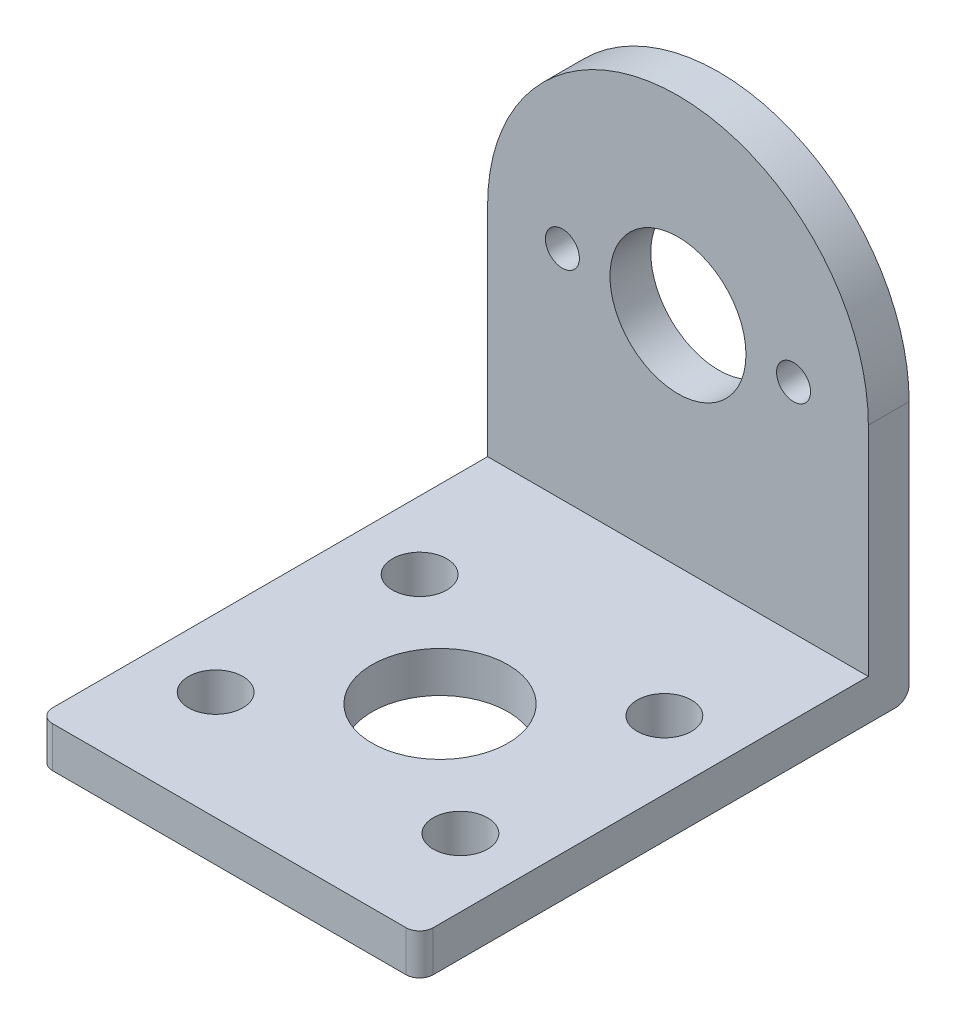
ISO-10303-21;
HEADER;
FILE_DESCRIPTION(('STEP AP214'),'2;1');
FILE_NAME('part.step','',(''),(''),'','','');
FILE_SCHEMA(('AUTOMOTIVE_DESIGN { 1 0 10303 214 1 1 1 1 }'));
ENDSEC;
DATA;
#1=APPLICATION_CONTEXT('core data for automotive mechanical design processes');
#2=APPLICATION_PROTOCOL_DEFINITION('international standard','automotive_design',2000,#1);
#3=PRODUCT_CONTEXT('',#1,'mechanical');
#4=PRODUCT('Part','Part','',(#3));
#5=PRODUCT_RELATED_PRODUCT_CATEGORY('part','',(#4));
#6=PRODUCT_DEFINITION_FORMATION('','',#4);
#7=PRODUCT_DEFINITION_CONTEXT('part definition',#1,'design');
#8=PRODUCT_DEFINITION('design','',#6,#7);
#9=PRODUCT_DEFINITION_SHAPE('','',#8);
#10=(LENGTH_UNIT() NAMED_UNIT(*) SI_UNIT(.MILLI.,.METRE.));
#11=(NAMED_UNIT(*) PLANE_ANGLE_UNIT() SI_UNIT($,.RADIAN.));
#12=(NAMED_UNIT(*) SI_UNIT($,.STERADIAN.) SOLID_ANGLE_UNIT());
#13=UNCERTAINTY_MEASURE_WITH_UNIT(LENGTH_MEASURE(1.E-05),#10,'distance_accuracy_value','');
#14=(GEOMETRIC_REPRESENTATION_CONTEXT(3) GLOBAL_UNCERTAINTY_ASSIGNED_CONTEXT((#13)) GLOBAL_UNIT_ASSIGNED_CONTEXT((#10,
#11,#12)) REPRESENTATION_CONTEXT('',''));
#15=CARTESIAN_POINT('',(0.,0.,0.));
#16=DIRECTION('',(0.,0.,1.));
#17=DIRECTION('',(1.,0.,0.));
#18=AXIS2_PLACEMENT_3D('',#15,#16,#17);
#19=CARTESIAN_POINT('',(0.,0.,3.));
#20=DIRECTION('',(0.,0.,1.));
#21=DIRECTION('',(1.,0.,0.));
#22=AXIS2_PLACEMENT_3D('',#19,#20,#21);
#23=PLANE('',#22);
#24=DIRECTION('',(-1.,0.,0.));
#25=VECTOR('',#24,1.);
#26=CARTESIAN_POINT('',(-14.,-16.,3.));
#27=LINE('',#26,#25);
#28=CARTESIAN_POINT('',(14.,-16.,3.));
#29=VERTEX_POINT('',#28);
#30=CARTESIAN_POINT('',(-14.,-16.,3.));
#31=VERTEX_POINT('',#30);
#32=EDGE_CURVE('E125',#29,#31,#27,.T.);
#33=ORIENTED_EDGE('',*,*,#32,.F.);
#34=DIRECTION('',(0.,1.,0.));
#35=VECTOR('',#34,1.);
#36=CARTESIAN_POINT('',(14.,0.,3.));
#37=LINE('',#36,#35);
#38=CARTESIAN_POINT('',(14.,0.,3.));
#39=VERTEX_POINT('',#38);
#40=EDGE_CURVE('E130',#29,#39,#37,.T.);
#41=ORIENTED_EDGE('',*,*,#40,.T.);
#42=CARTESIAN_POINT('',(0.,0.,3.));
#43=DIRECTION('',(0.,0.,1.));
#44=DIRECTION('',(1.,0.,0.));
#45=AXIS2_PLACEMENT_3D('',#42,#43,#44);
#46=CIRCLE('',#45,14.);
#47=CARTESIAN_POINT('',(-14.,0.,3.));
#48=VERTEX_POINT('',#47);
#49=EDGE_CURVE('E128',#39,#48,#46,.T.);
#50=ORIENTED_EDGE('',*,*,#49,.T.);
#51=DIRECTION('',(0.,-1.,0.));
#52=VECTOR('',#51,1.);
#53=CARTESIAN_POINT('',(-14.,0.,3.));
#54=LINE('',#53,#52);
#55=EDGE_CURVE('E113',#48,#31,#54,.T.);
#56=ORIENTED_EDGE('',*,*,#55,.T.);
#57=EDGE_LOOP('',(#33,#41,#50,#56));
#58=FACE_BOUND('',#57,.T.);
#59=CARTESIAN_POINT('',(-8.5,0.,3.));
#60=DIRECTION('',(0.,0.,1.));
#61=DIRECTION('',(1.,0.,0.));
#62=AXIS2_PLACEMENT_3D('',#59,#60,#61);
#63=CIRCLE('',#62,1.25);
#64=CARTESIAN_POINT('',(-7.25,0.,3.));
#65=VERTEX_POINT('',#64);
#66=EDGE_CURVE('E151',#65,#65,#63,.T.);
#67=ORIENTED_EDGE('',*,*,#66,.F.);
#68=EDGE_LOOP('',(#67));
#69=FACE_BOUND('',#68,.T.);
#70=CARTESIAN_POINT('',(0.,0.,3.));
#71=DIRECTION('',(0.,0.,1.));
#72=DIRECTION('',(1.,0.,0.));
#73=AXIS2_PLACEMENT_3D('',#70,#71,#72);
#74=CIRCLE('',#73,5.);
#75=CARTESIAN_POINT('',(5.,0.,3.));
#76=VERTEX_POINT('',#75);
#77=EDGE_CURVE('E157',#76,#76,#74,.T.);
#78=ORIENTED_EDGE('',*,*,#77,.F.);
#79=EDGE_LOOP('',(#78));
#80=FACE_BOUND('',#79,.T.);
#81=CARTESIAN_POINT('',(8.5,0.,3.));
#82=DIRECTION('',(0.,0.,1.));
#83=DIRECTION('',(1.,0.,0.));
#84=AXIS2_PLACEMENT_3D('',#81,#82,#83);
#85=CIRCLE('',#84,1.25);
#86=CARTESIAN_POINT('',(9.75,0.,3.));
#87=VERTEX_POINT('',#86);
#88=EDGE_CURVE('E145',#87,#87,#85,.T.);
#89=ORIENTED_EDGE('',*,*,#88,.F.);
#90=EDGE_LOOP('',(#89));
#91=FACE_BOUND('',#90,.T.);
#92=ADVANCED_FACE('F38',(#58,#69,#80,#91),#23,.T.);
#93=CARTESIAN_POINT('',(0.,0.,0.));
#94=DIRECTION('',(0.,0.,1.));
#95=DIRECTION('',(1.,0.,0.));
#96=AXIS2_PLACEMENT_3D('',#93,#94,#95);
#97=PLANE('',#96);
#98=DIRECTION('',(0.,1.,0.));
#99=VECTOR('',#98,1.);
#100=CARTESIAN_POINT('',(14.,0.,0.));
#101=LINE('',#100,#99);
#102=CARTESIAN_POINT('',(14.,-18.,0.));
#103=VERTEX_POINT('',#102);
#104=CARTESIAN_POINT('',(14.,0.,0.));
#105=VERTEX_POINT('',#104);
#106=EDGE_CURVE('E163',#103,#105,#101,.T.);
#107=ORIENTED_EDGE('',*,*,#106,.F.);
#108=DIRECTION('',(1.,0.,0.));
#109=VECTOR('',#108,1.);
#110=CARTESIAN_POINT('',(0.,-18.,0.));
#111=LINE('',#110,#109);
#112=CARTESIAN_POINT('',(-14.,-18.,0.));
#113=VERTEX_POINT('',#112);
#114=EDGE_CURVE('E11',#103,#113,#111,.F.);
#115=ORIENTED_EDGE('',*,*,#114,.T.);
#116=DIRECTION('',(0.,-1.,0.));
#117=VECTOR('',#116,1.);
#118=CARTESIAN_POINT('',(-14.,0.,0.));
#119=LINE('',#118,#117);
#120=CARTESIAN_POINT('',(-14.,0.,0.));
#121=VERTEX_POINT('',#120);
#122=EDGE_CURVE('E169',#121,#113,#119,.T.);
#123=ORIENTED_EDGE('',*,*,#122,.F.);
#124=CARTESIAN_POINT('',(0.,0.,0.));
#125=DIRECTION('',(0.,0.,1.));
#126=DIRECTION('',(1.,0.,0.));
#127=AXIS2_PLACEMENT_3D('',#124,#125,#126);
#128=CIRCLE('',#127,14.);
#129=EDGE_CURVE('E160',#105,#121,#128,.T.);
#130=ORIENTED_EDGE('',*,*,#129,.F.);
#131=EDGE_LOOP('',(#107,#115,#123,#130));
#132=FACE_BOUND('',#131,.T.);
#133=CARTESIAN_POINT('',(0.,0.,0.));
#134=DIRECTION('',(0.,0.,1.));
#135=DIRECTION('',(1.,0.,0.));
#136=AXIS2_PLACEMENT_3D('',#133,#134,#135);
#137=CIRCLE('',#136,5.);
#138=CARTESIAN_POINT('',(5.,0.,0.));
#139=VERTEX_POINT('',#138);
#140=EDGE_CURVE('E154',#139,#139,#137,.T.);
#141=ORIENTED_EDGE('',*,*,#140,.T.);
#142=EDGE_LOOP('',(#141));
#143=FACE_BOUND('',#142,.T.);
#144=CARTESIAN_POINT('',(-8.5,0.,0.));
#145=DIRECTION('',(0.,0.,1.));
#146=DIRECTION('',(1.,0.,0.));
#147=AXIS2_PLACEMENT_3D('',#144,#145,#146);
#148=CIRCLE('',#147,1.25);
#149=CARTESIAN_POINT('',(-7.25,0.,0.));
#150=VERTEX_POINT('',#149);
#151=EDGE_CURVE('E148',#150,#150,#148,.T.);
#152=ORIENTED_EDGE('',*,*,#151,.T.);
#153=EDGE_LOOP('',(#152));
#154=FACE_BOUND('',#153,.T.);
#155=CARTESIAN_POINT('',(8.5,0.,0.));
#156=DIRECTION('',(0.,0.,1.));
#157=DIRECTION('',(1.,0.,0.));
#158=AXIS2_PLACEMENT_3D('',#155,#156,#157);
#159=CIRCLE('',#158,1.25);
#160=CARTESIAN_POINT('',(9.75,0.,0.));
#161=VERTEX_POINT('',#160);
#162=EDGE_CURVE('E144',#161,#161,#159,.T.);
#163=ORIENTED_EDGE('',*,*,#162,.T.);
#164=EDGE_LOOP('',(#163));
#165=FACE_BOUND('',#164,.T.);
#166=ADVANCED_FACE('F236',(#132,#143,#154,#165),#97,.F.);
#167=CARTESIAN_POINT('',(0.,0.,3.));
#168=DIRECTION('',(0.,0.,-1.));
#169=DIRECTION('',(-1.,0.,0.));
#170=AXIS2_PLACEMENT_3D('',#167,#168,#169);
#171=CYLINDRICAL_SURFACE('',#170,14.);
#172=ORIENTED_EDGE('',*,*,#129,.T.);
#173=DIRECTION('',(0.,0.,-1.));
#174=VECTOR('',#173,1.);
#175=CARTESIAN_POINT('',(-14.,0.,3.));
#176=LINE('',#175,#174);
#177=EDGE_CURVE('E179',#48,#121,#176,.T.);
#178=ORIENTED_EDGE('',*,*,#177,.F.);
#179=ORIENTED_EDGE('',*,*,#49,.F.);
#180=DIRECTION('',(0.,0.,-1.));
#181=VECTOR('',#180,1.);
#182=CARTESIAN_POINT('',(14.,0.,3.));
#183=LINE('',#182,#181);
#184=EDGE_CURVE('E166',#39,#105,#183,.T.);
#185=ORIENTED_EDGE('',*,*,#184,.T.);
#186=EDGE_LOOP('',(#172,#178,#179,#185));
#187=FACE_BOUND('',#186,.T.);
#188=ADVANCED_FACE('F241',(#187),#171,.T.);
#189=CARTESIAN_POINT('',(-14.,0.,3.));
#190=DIRECTION('',(1.,0.,0.));
#191=DIRECTION('',(0.,0.,-1.));
#192=AXIS2_PLACEMENT_3D('',#189,#190,#191);
#193=PLANE('',#192);
#194=DIRECTION('',(0.,0.,-1.));
#195=VECTOR('',#194,1.);
#196=CARTESIAN_POINT('',(-14.,-19.,3.));
#197=LINE('',#196,#195);
#198=CARTESIAN_POINT('',(-14.,-19.,35.));
#199=VERTEX_POINT('',#198);
#200=CARTESIAN_POINT('',(-14.,-19.,1.));
#201=VERTEX_POINT('',#200);
#202=EDGE_CURVE('E177',#199,#201,#197,.T.);
#203=ORIENTED_EDGE('',*,*,#202,.F.);
#204=DIRECTION('',(0.,-1.,0.));
#205=VECTOR('',#204,1.);
#206=CARTESIAN_POINT('',(-14.,0.,35.));
#207=LINE('',#206,#205);
#208=CARTESIAN_POINT('',(-14.,-16.,35.));
#209=VERTEX_POINT('',#208);
#210=EDGE_CURVE('E47',#199,#209,#207,.F.);
#211=ORIENTED_EDGE('',*,*,#210,.T.);
#212=DIRECTION('',(0.,0.,-1.));
#213=VECTOR('',#212,1.);
#214=CARTESIAN_POINT('',(-14.,-16.,36.));
#215=LINE('',#214,#213);
#216=EDGE_CURVE('E109',#209,#31,#215,.T.);
#217=ORIENTED_EDGE('',*,*,#216,.T.);
#218=ORIENTED_EDGE('',*,*,#55,.F.);
#219=ORIENTED_EDGE('',*,*,#177,.T.);
#220=ORIENTED_EDGE('',*,*,#122,.T.);
#221=CARTESIAN_POINT('',(-14.,-18.,1.));
#222=DIRECTION('',(1.,0.,0.));
#223=DIRECTION('',(0.,0.,-1.));
#224=AXIS2_PLACEMENT_3D('',#221,#222,#223);
#225=CIRCLE('',#224,1.);
#226=EDGE_CURVE('E60',#113,#201,#225,.F.);
#227=ORIENTED_EDGE('',*,*,#226,.T.);
#228=EDGE_LOOP('',(#203,#211,#217,#218,#219,#220,#227));
#229=FACE_BOUND('',#228,.T.);
#230=ADVANCED_FACE('F111',(#229),#193,.F.);
#231=CARTESIAN_POINT('',(14.,-19.,3.));
#232=DIRECTION('',(0.,1.,0.));
#233=DIRECTION('',(0.,0.,1.));
#234=AXIS2_PLACEMENT_3D('',#231,#232,#233);
#235=PLANE('',#234);
#236=CARTESIAN_POINT('',(-9.,-19.,13.));
#237=DIRECTION('',(0.,-1.,0.));
#238=DIRECTION('',(0.,0.,-1.));
#239=AXIS2_PLACEMENT_3D('',#236,#237,#238);
#240=CIRCLE('',#239,2.);
#241=CARTESIAN_POINT('',(-9.,-19.,11.));
#242=VERTEX_POINT('',#241);
#243=EDGE_CURVE('E318',#242,#242,#240,.T.);
#244=ORIENTED_EDGE('',*,*,#243,.F.);
#245=EDGE_LOOP('',(#244));
#246=FACE_BOUND('',#245,.T.);
#247=CARTESIAN_POINT('',(9.,-19.,28.));
#248=DIRECTION('',(0.,-1.,0.));
#249=DIRECTION('',(0.,0.,-1.));
#250=AXIS2_PLACEMENT_3D('',#247,#248,#249);
#251=CIRCLE('',#250,2.);
#252=CARTESIAN_POINT('',(9.,-19.,26.));
#253=VERTEX_POINT('',#252);
#254=EDGE_CURVE('E321',#253,#253,#251,.T.);
#255=ORIENTED_EDGE('',*,*,#254,.F.);
#256=EDGE_LOOP('',(#255));
#257=FACE_BOUND('',#256,.T.);
#258=CARTESIAN_POINT('',(9.,-19.,13.));
#259=DIRECTION('',(0.,-1.,0.));
#260=DIRECTION('',(0.,0.,-1.));
#261=AXIS2_PLACEMENT_3D('',#258,#259,#260);
#262=CIRCLE('',#261,2.);
#263=CARTESIAN_POINT('',(9.,-19.,11.));
#264=VERTEX_POINT('',#263);
#265=EDGE_CURVE('E324',#264,#264,#262,.T.);
#266=ORIENTED_EDGE('',*,*,#265,.F.);
#267=EDGE_LOOP('',(#266));
#268=FACE_BOUND('',#267,.T.);
#269=CARTESIAN_POINT('',(0.,-19.,20.5));
#270=DIRECTION('',(0.,-1.,0.));
#271=DIRECTION('',(0.,0.,-1.));
#272=AXIS2_PLACEMENT_3D('',#269,#270,#271);
#273=CIRCLE('',#272,5.);
#274=CARTESIAN_POINT('',(0.,-19.,15.5));
#275=VERTEX_POINT('',#274);
#276=EDGE_CURVE('E326',#275,#275,#273,.T.);
#277=ORIENTED_EDGE('',*,*,#276,.F.);
#278=EDGE_LOOP('',(#277));
#279=FACE_BOUND('',#278,.T.);
#280=CARTESIAN_POINT('',(-9.,-19.,28.));
#281=DIRECTION('',(0.,-1.,0.));
#282=DIRECTION('',(0.,0.,-1.));
#283=AXIS2_PLACEMENT_3D('',#280,#281,#282);
#284=CIRCLE('',#283,2.);
#285=CARTESIAN_POINT('',(-9.,-19.,26.));
#286=VERTEX_POINT('',#285);
#287=EDGE_CURVE('E208',#286,#286,#284,.T.);
#288=ORIENTED_EDGE('',*,*,#287,.F.);
#289=EDGE_LOOP('',(#288));
#290=FACE_BOUND('',#289,.T.);
#291=DIRECTION('',(0.,0.,-1.));
#292=VECTOR('',#291,1.);
#293=CARTESIAN_POINT('',(14.,-19.,3.));
#294=LINE('',#293,#292);
#295=CARTESIAN_POINT('',(14.,-19.,35.));
#296=VERTEX_POINT('',#295);
#297=CARTESIAN_POINT('',(14.,-19.,1.));
#298=VERTEX_POINT('',#297);
#299=EDGE_CURVE('E174',#296,#298,#294,.T.);
#300=ORIENTED_EDGE('',*,*,#299,.F.);
#301=CARTESIAN_POINT('',(13.,-19.,35.));
#302=DIRECTION('',(0.,1.,0.));
#303=DIRECTION('',(0.,0.,1.));
#304=AXIS2_PLACEMENT_3D('',#301,#302,#303);
#305=CIRCLE('',#304,1.);
#306=CARTESIAN_POINT('',(13.,-19.,36.));
#307=VERTEX_POINT('',#306);
#308=EDGE_CURVE('E200',#296,#307,#305,.F.);
#309=ORIENTED_EDGE('',*,*,#308,.T.);
#310=DIRECTION('',(1.,0.,0.));
#311=VECTOR('',#310,1.);
#312=CARTESIAN_POINT('',(-14.,-19.,36.));
#313=LINE('',#312,#311);
#314=CARTESIAN_POINT('',(-13.,-19.,36.));
#315=VERTEX_POINT('',#314);
#316=EDGE_CURVE('E135',#315,#307,#313,.T.);
#317=ORIENTED_EDGE('',*,*,#316,.F.);
#318=CARTESIAN_POINT('',(-13.,-19.,35.));
#319=DIRECTION('',(0.,1.,0.));
#320=DIRECTION('',(0.,0.,1.));
#321=AXIS2_PLACEMENT_3D('',#318,#319,#320);
#322=CIRCLE('',#321,1.);
#323=EDGE_CURVE('E198',#315,#199,#322,.F.);
#324=ORIENTED_EDGE('',*,*,#323,.T.);
#325=ORIENTED_EDGE('',*,*,#202,.T.);
#326=DIRECTION('',(1.,0.,0.));
#327=VECTOR('',#326,1.);
#328=CARTESIAN_POINT('',(14.,-19.,1.));
#329=LINE('',#328,#327);
#330=EDGE_CURVE('E195',#201,#298,#329,.T.);
#331=ORIENTED_EDGE('',*,*,#330,.T.);
#332=EDGE_LOOP('',(#300,#309,#317,#324,#325,#331));
#333=FACE_BOUND('',#332,.T.);
#334=ADVANCED_FACE('F250',(#246,#257,#268,#279,#290,#333),#235,.F.);
#335=CARTESIAN_POINT('',(14.,0.,3.));
#336=DIRECTION('',(-1.,0.,0.));
#337=DIRECTION('',(0.,0.,1.));
#338=AXIS2_PLACEMENT_3D('',#335,#336,#337);
#339=PLANE('',#338);
#340=DIRECTION('',(0.,0.,-1.));
#341=VECTOR('',#340,1.);
#342=CARTESIAN_POINT('',(14.,-16.,36.));
#343=LINE('',#342,#341);
#344=CARTESIAN_POINT('',(14.,-16.,35.));
#345=VERTEX_POINT('',#344);
#346=EDGE_CURVE('E119',#345,#29,#343,.T.);
#347=ORIENTED_EDGE('',*,*,#346,.F.);
#348=DIRECTION('',(0.,1.,0.));
#349=VECTOR('',#348,1.);
#350=CARTESIAN_POINT('',(14.,0.,35.));
#351=LINE('',#350,#349);
#352=EDGE_CURVE('E193',#345,#296,#351,.F.);
#353=ORIENTED_EDGE('',*,*,#352,.T.);
#354=ORIENTED_EDGE('',*,*,#299,.T.);
#355=CARTESIAN_POINT('',(14.,-18.,1.));
#356=DIRECTION('',(-1.,0.,0.));
#357=DIRECTION('',(0.,0.,1.));
#358=AXIS2_PLACEMENT_3D('',#355,#356,#357);
#359=CIRCLE('',#358,1.);
#360=EDGE_CURVE('E191',#298,#103,#359,.F.);
#361=ORIENTED_EDGE('',*,*,#360,.T.);
#362=ORIENTED_EDGE('',*,*,#106,.T.);
#363=ORIENTED_EDGE('',*,*,#184,.F.);
#364=ORIENTED_EDGE('',*,*,#40,.F.);
#365=EDGE_LOOP('',(#347,#353,#354,#361,#362,#363,#364));
#366=FACE_BOUND('',#365,.T.);
#367=ADVANCED_FACE('F247',(#366),#339,.F.);
#368=CARTESIAN_POINT('',(0.,0.,3.));
#369=DIRECTION('',(0.,0.,-1.));
#370=DIRECTION('',(-1.,0.,0.));
#371=AXIS2_PLACEMENT_3D('',#368,#369,#370);
#372=CYLINDRICAL_SURFACE('',#371,5.);
#373=ORIENTED_EDGE('',*,*,#77,.T.);
#374=EDGE_LOOP('',(#373));
#375=FACE_BOUND('',#374,.T.);
#376=ORIENTED_EDGE('',*,*,#140,.F.);
#377=EDGE_LOOP('',(#376));
#378=FACE_BOUND('',#377,.T.);
#379=ADVANCED_FACE('F244',(#375,#378),#372,.F.);
#380=CARTESIAN_POINT('',(-8.5,0.,3.));
#381=DIRECTION('',(0.,0.,-1.));
#382=DIRECTION('',(-1.,0.,0.));
#383=AXIS2_PLACEMENT_3D('',#380,#381,#382);
#384=CYLINDRICAL_SURFACE('',#383,1.25);
#385=ORIENTED_EDGE('',*,*,#66,.T.);
#386=EDGE_LOOP('',(#385));
#387=FACE_BOUND('',#386,.T.);
#388=ORIENTED_EDGE('',*,*,#151,.F.);
#389=EDGE_LOOP('',(#388));
#390=FACE_BOUND('',#389,.T.);
#391=ADVANCED_FACE('F293',(#387,#390),#384,.F.);
#392=CARTESIAN_POINT('',(8.5,0.,3.));
#393=DIRECTION('',(0.,0.,-1.));
#394=DIRECTION('',(-1.,0.,0.));
#395=AXIS2_PLACEMENT_3D('',#392,#393,#394);
#396=CYLINDRICAL_SURFACE('',#395,1.25);
#397=ORIENTED_EDGE('',*,*,#88,.T.);
#398=EDGE_LOOP('',(#397));
#399=FACE_BOUND('',#398,.T.);
#400=ORIENTED_EDGE('',*,*,#162,.F.);
#401=EDGE_LOOP('',(#400));
#402=FACE_BOUND('',#401,.T.);
#403=ADVANCED_FACE('F291',(#399,#402),#396,.F.);
#404=CARTESIAN_POINT('',(-14.,-16.,36.));
#405=DIRECTION('',(0.,-1.,0.));
#406=DIRECTION('',(0.,0.,-1.));
#407=AXIS2_PLACEMENT_3D('',#404,#405,#406);
#408=PLANE('',#407);
#409=CARTESIAN_POINT('',(-9.,-16.,13.));
#410=DIRECTION('',(0.,-1.,0.));
#411=DIRECTION('',(0.,0.,-1.));
#412=AXIS2_PLACEMENT_3D('',#409,#410,#411);
#413=CIRCLE('',#412,2.);
#414=CARTESIAN_POINT('',(-9.,-16.,11.));
#415=VERTEX_POINT('',#414);
#416=EDGE_CURVE('E42',#415,#415,#413,.T.);
#417=ORIENTED_EDGE('',*,*,#416,.T.);
#418=EDGE_LOOP('',(#417));
#419=FACE_BOUND('',#418,.T.);
#420=CARTESIAN_POINT('',(9.,-16.,28.));
#421=DIRECTION('',(0.,-1.,0.));
#422=DIRECTION('',(0.,0.,-1.));
#423=AXIS2_PLACEMENT_3D('',#420,#421,#422);
#424=CIRCLE('',#423,2.);
#425=CARTESIAN_POINT('',(9.,-16.,26.));
#426=VERTEX_POINT('',#425);
#427=EDGE_CURVE('E140',#426,#426,#424,.T.);
#428=ORIENTED_EDGE('',*,*,#427,.T.);
#429=EDGE_LOOP('',(#428));
#430=FACE_BOUND('',#429,.T.);
#431=CARTESIAN_POINT('',(9.,-16.,13.));
#432=DIRECTION('',(0.,-1.,0.));
#433=DIRECTION('',(0.,0.,-1.));
#434=AXIS2_PLACEMENT_3D('',#431,#432,#433);
#435=CIRCLE('',#434,2.);
#436=CARTESIAN_POINT('',(9.,-16.,11.));
#437=VERTEX_POINT('',#436);
#438=EDGE_CURVE('E211',#437,#437,#435,.T.);
#439=ORIENTED_EDGE('',*,*,#438,.T.);
#440=EDGE_LOOP('',(#439));
#441=FACE_BOUND('',#440,.T.);
#442=CARTESIAN_POINT('',(0.,-16.,20.5));
#443=DIRECTION('',(0.,-1.,0.));
#444=DIRECTION('',(0.,0.,-1.));
#445=AXIS2_PLACEMENT_3D('',#442,#443,#444);
#446=CIRCLE('',#445,5.);
#447=CARTESIAN_POINT('',(0.,-16.,15.5));
#448=VERTEX_POINT('',#447);
#449=EDGE_CURVE('E207',#448,#448,#446,.T.);
#450=ORIENTED_EDGE('',*,*,#449,.T.);
#451=EDGE_LOOP('',(#450));
#452=FACE_BOUND('',#451,.T.);
#453=CARTESIAN_POINT('',(-9.,-16.,28.));
#454=DIRECTION('',(0.,-1.,0.));
#455=DIRECTION('',(0.,0.,-1.));
#456=AXIS2_PLACEMENT_3D('',#453,#454,#455);
#457=CIRCLE('',#456,2.);
#458=CARTESIAN_POINT('',(-9.,-16.,26.));
#459=VERTEX_POINT('',#458);
#460=EDGE_CURVE('E204',#459,#459,#457,.T.);
#461=ORIENTED_EDGE('',*,*,#460,.T.);
#462=EDGE_LOOP('',(#461));
#463=FACE_BOUND('',#462,.T.);
#464=DIRECTION('',(-1.,0.,0.));
#465=VECTOR('',#464,1.);
#466=CARTESIAN_POINT('',(-14.,-16.,36.));
#467=LINE('',#466,#465);
#468=CARTESIAN_POINT('',(13.,-16.,36.));
#469=VERTEX_POINT('',#468);
#470=CARTESIAN_POINT('',(-13.,-16.,36.));
#471=VERTEX_POINT('',#470);
#472=EDGE_CURVE('E120',#469,#471,#467,.T.);
#473=ORIENTED_EDGE('',*,*,#472,.F.);
#474=CARTESIAN_POINT('',(13.,-16.,35.));
#475=DIRECTION('',(0.,-1.,0.));
#476=DIRECTION('',(0.,0.,-1.));
#477=AXIS2_PLACEMENT_3D('',#474,#475,#476);
#478=CIRCLE('',#477,1.);
#479=EDGE_CURVE('E189',#469,#345,#478,.F.);
#480=ORIENTED_EDGE('',*,*,#479,.T.);
#481=ORIENTED_EDGE('',*,*,#346,.T.);
#482=ORIENTED_EDGE('',*,*,#32,.T.);
#483=ORIENTED_EDGE('',*,*,#216,.F.);
#484=CARTESIAN_POINT('',(-13.,-16.,35.));
#485=DIRECTION('',(0.,-1.,0.));
#486=DIRECTION('',(0.,0.,-1.));
#487=AXIS2_PLACEMENT_3D('',#484,#485,#486);
#488=CIRCLE('',#487,1.);
#489=EDGE_CURVE('E187',#209,#471,#488,.F.);
#490=ORIENTED_EDGE('',*,*,#489,.T.);
#491=EDGE_LOOP('',(#473,#480,#481,#482,#483,#490));
#492=FACE_BOUND('',#491,.T.);
#493=ADVANCED_FACE('F133',(#419,#430,#441,#452,#463,#492),#408,.F.);
#494=CARTESIAN_POINT('',(0.,0.,36.));
#495=DIRECTION('',(0.,0.,-1.));
#496=DIRECTION('',(-1.,0.,0.));
#497=AXIS2_PLACEMENT_3D('',#494,#495,#496);
#498=PLANE('',#497);
#499=ORIENTED_EDGE('',*,*,#316,.T.);
#500=DIRECTION('',(0.,1.,0.));
#501=VECTOR('',#500,1.);
#502=CARTESIAN_POINT('',(13.,0.,36.));
#503=LINE('',#502,#501);
#504=EDGE_CURVE('E184',#307,#469,#503,.T.);
#505=ORIENTED_EDGE('',*,*,#504,.T.);
#506=ORIENTED_EDGE('',*,*,#472,.T.);
#507=DIRECTION('',(0.,-1.,0.));
#508=VECTOR('',#507,1.);
#509=CARTESIAN_POINT('',(-13.,0.,36.));
#510=LINE('',#509,#508);
#511=EDGE_CURVE('E181',#471,#315,#510,.T.);
#512=ORIENTED_EDGE('',*,*,#511,.T.);
#513=EDGE_LOOP('',(#499,#505,#506,#512));
#514=FACE_BOUND('',#513,.T.);
#515=ADVANCED_FACE('F263',(#514),#498,.F.);
#516=CARTESIAN_POINT('',(13.,0.,35.));
#517=DIRECTION('',(0.,1.,0.));
#518=DIRECTION('',(0.,0.,1.));
#519=AXIS2_PLACEMENT_3D('',#516,#517,#518);
#520=CYLINDRICAL_SURFACE('',#519,1.);
#521=ORIENTED_EDGE('',*,*,#308,.F.);
#522=ORIENTED_EDGE('',*,*,#352,.F.);
#523=ORIENTED_EDGE('',*,*,#479,.F.);
#524=ORIENTED_EDGE('',*,*,#504,.F.);
#525=EDGE_LOOP('',(#521,#522,#523,#524));
#526=FACE_BOUND('',#525,.T.);
#527=ADVANCED_FACE('F260',(#526),#520,.T.);
#528=CARTESIAN_POINT('',(-13.,0.,35.));
#529=DIRECTION('',(0.,-1.,0.));
#530=DIRECTION('',(0.,0.,-1.));
#531=AXIS2_PLACEMENT_3D('',#528,#529,#530);
#532=CYLINDRICAL_SURFACE('',#531,1.);
#533=ORIENTED_EDGE('',*,*,#489,.F.);
#534=ORIENTED_EDGE('',*,*,#210,.F.);
#535=ORIENTED_EDGE('',*,*,#323,.F.);
#536=ORIENTED_EDGE('',*,*,#511,.F.);
#537=EDGE_LOOP('',(#533,#534,#535,#536));
#538=FACE_BOUND('',#537,.T.);
#539=ADVANCED_FACE('F262',(#538),#532,.T.);
#540=CARTESIAN_POINT('',(14.,-18.,1.));
#541=DIRECTION('',(1.,0.,0.));
#542=DIRECTION('',(0.,0.,-1.));
#543=AXIS2_PLACEMENT_3D('',#540,#541,#542);
#544=CYLINDRICAL_SURFACE('',#543,1.);
#545=ORIENTED_EDGE('',*,*,#226,.F.);
#546=ORIENTED_EDGE('',*,*,#114,.F.);
#547=ORIENTED_EDGE('',*,*,#360,.F.);
#548=ORIENTED_EDGE('',*,*,#330,.F.);
#549=EDGE_LOOP('',(#545,#546,#547,#548));
#550=FACE_BOUND('',#549,.T.);
#551=ADVANCED_FACE('F40',(#550),#544,.T.);
#552=CARTESIAN_POINT('',(-9.,-9.,28.));
#553=DIRECTION('',(0.,-1.,0.));
#554=DIRECTION('',(0.,0.,-1.));
#555=AXIS2_PLACEMENT_3D('',#552,#553,#554);
#556=CYLINDRICAL_SURFACE('',#555,2.);
#557=ORIENTED_EDGE('',*,*,#287,.T.);
#558=EDGE_LOOP('',(#557));
#559=FACE_BOUND('',#558,.T.);
#560=ORIENTED_EDGE('',*,*,#460,.F.);
#561=EDGE_LOOP('',(#560));
#562=FACE_BOUND('',#561,.T.);
#563=ADVANCED_FACE('F270',(#559,#562),#556,.F.);
#564=CARTESIAN_POINT('',(0.,-9.,20.5));
#565=DIRECTION('',(0.,-1.,0.));
#566=DIRECTION('',(0.,0.,-1.));
#567=AXIS2_PLACEMENT_3D('',#564,#565,#566);
#568=CYLINDRICAL_SURFACE('',#567,5.);
#569=ORIENTED_EDGE('',*,*,#276,.T.);
#570=EDGE_LOOP('',(#569));
#571=FACE_BOUND('',#570,.T.);
#572=ORIENTED_EDGE('',*,*,#449,.F.);
#573=EDGE_LOOP('',(#572));
#574=FACE_BOUND('',#573,.T.);
#575=ADVANCED_FACE('F230',(#571,#574),#568,.F.);
#576=CARTESIAN_POINT('',(9.,-9.,13.));
#577=DIRECTION('',(0.,-1.,0.));
#578=DIRECTION('',(0.,0.,-1.));
#579=AXIS2_PLACEMENT_3D('',#576,#577,#578);
#580=CYLINDRICAL_SURFACE('',#579,2.);
#581=ORIENTED_EDGE('',*,*,#265,.T.);
#582=EDGE_LOOP('',(#581));
#583=FACE_BOUND('',#582,.T.);
#584=ORIENTED_EDGE('',*,*,#438,.F.);
#585=EDGE_LOOP('',(#584));
#586=FACE_BOUND('',#585,.T.);
#587=ADVANCED_FACE('F221',(#583,#586),#580,.F.);
#588=CARTESIAN_POINT('',(9.,-9.,28.));
#589=DIRECTION('',(0.,-1.,0.));
#590=DIRECTION('',(0.,0.,-1.));
#591=AXIS2_PLACEMENT_3D('',#588,#589,#590);
#592=CYLINDRICAL_SURFACE('',#591,2.);
#593=ORIENTED_EDGE('',*,*,#254,.T.);
#594=EDGE_LOOP('',(#593));
#595=FACE_BOUND('',#594,.T.);
#596=ORIENTED_EDGE('',*,*,#427,.F.);
#597=EDGE_LOOP('',(#596));
#598=FACE_BOUND('',#597,.T.);
#599=ADVANCED_FACE('F218',(#595,#598),#592,.F.);
#600=CARTESIAN_POINT('',(-9.,-9.,13.));
#601=DIRECTION('',(0.,-1.,0.));
#602=DIRECTION('',(0.,0.,-1.));
#603=AXIS2_PLACEMENT_3D('',#600,#601,#602);
#604=CYLINDRICAL_SURFACE('',#603,2.);
#605=ORIENTED_EDGE('',*,*,#243,.T.);
#606=EDGE_LOOP('',(#605));
#607=FACE_BOUND('',#606,.T.);
#608=ORIENTED_EDGE('',*,*,#416,.F.);
#609=EDGE_LOOP('',(#608));
#610=FACE_BOUND('',#609,.T.);
#611=ADVANCED_FACE('F220',(#607,#610),#604,.F.);
#612=CLOSED_SHELL('',(#92,#166,#188,#230,#334,#367,#379,#391,#403,#493,#515,#527,#539,#551,#563,
#575,#587,#599,#611));
#613=MANIFOLD_SOLID_BREP('B2',#612);
#614=ADVANCED_BREP_SHAPE_REPRESENTATION('',(#18,#613),#14);
#615=SHAPE_DEFINITION_REPRESENTATION(#9,#614);
ENDSEC;
END-ISO-10303-21;
